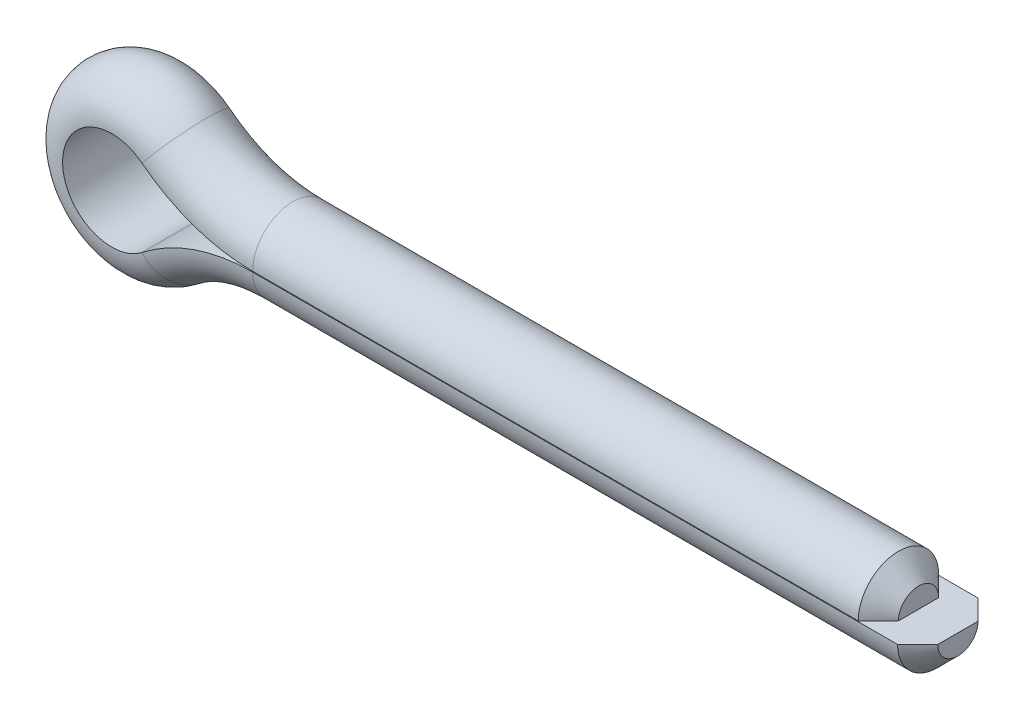
ISO-10303-21;
HEADER;
FILE_DESCRIPTION(('STEP AP214'),'2;1');
FILE_NAME('part.step','',(''),(''),'','','');
FILE_SCHEMA(('AUTOMOTIVE_DESIGN { 1 0 10303 214 1 1 1 1 }'));
ENDSEC;
DATA;
#1=APPLICATION_CONTEXT('core data for automotive mechanical design processes');
#2=APPLICATION_PROTOCOL_DEFINITION('international standard','automotive_design',2000,#1);
#3=PRODUCT_CONTEXT('',#1,'mechanical');
#4=PRODUCT('Part','Part','',(#3));
#5=PRODUCT_RELATED_PRODUCT_CATEGORY('part','',(#4));
#6=PRODUCT_DEFINITION_FORMATION('','',#4);
#7=PRODUCT_DEFINITION_CONTEXT('part definition',#1,'design');
#8=PRODUCT_DEFINITION('design','',#6,#7);
#9=PRODUCT_DEFINITION_SHAPE('','',#8);
#10=(LENGTH_UNIT() NAMED_UNIT(*) SI_UNIT(.MILLI.,.METRE.));
#11=(NAMED_UNIT(*) PLANE_ANGLE_UNIT() SI_UNIT($,.RADIAN.));
#12=(NAMED_UNIT(*) SI_UNIT($,.STERADIAN.) SOLID_ANGLE_UNIT());
#13=UNCERTAINTY_MEASURE_WITH_UNIT(LENGTH_MEASURE(1.E-05),#10,'distance_accuracy_value','');
#14=(GEOMETRIC_REPRESENTATION_CONTEXT(3) GLOBAL_UNCERTAINTY_ASSIGNED_CONTEXT((#13)) GLOBAL_UNIT_ASSIGNED_CONTEXT((#10,
#11,#12)) REPRESENTATION_CONTEXT('',''));
#15=CARTESIAN_POINT('',(0.,0.,0.));
#16=DIRECTION('',(0.,0.,1.));
#17=DIRECTION('',(1.,0.,0.));
#18=AXIS2_PLACEMENT_3D('',#15,#16,#17);
#19=CARTESIAN_POINT('',(-44.4499999999999,-0.0253999999999983,2.8575));
#20=DIRECTION('',(0.,-1.,0.));
#21=DIRECTION('',(1.,0.,0.));
#22=AXIS2_PLACEMENT_3D('',#19,#20,#21);
#23=PLANE('',#22);
#24=DIRECTION('',(1.,0.,0.));
#25=VECTOR('',#24,1.);
#26=CARTESIAN_POINT('',(-44.4499999999999,-0.0253999999999983,2.8575));
#27=LINE('',#26,#25);
#28=CARTESIAN_POINT('',(-44.4499999999999,-0.0253999999999983,2.8575));
#29=VERTEX_POINT('',#28);
#30=CARTESIAN_POINT('',(1.36525000000007,-0.0253999999999983,2.8575));
#31=VERTEX_POINT('',#30);
#32=EDGE_CURVE('E156',#29,#31,#27,.T.);
#33=ORIENTED_EDGE('',*,*,#32,.T.);
#34=DIRECTION('',(-0.707106781186542,0.,0.707106781186553));
#35=VECTOR('',#34,1.);
#36=CARTESIAN_POINT('',(4.22275000000003,-0.0253999999999983,0.));
#37=LINE('',#36,#35);
#38=CARTESIAN_POINT('',(2.79400000000005,-0.0253999999999983,1.42875));
#39=VERTEX_POINT('',#38);
#40=EDGE_CURVE('E167',#31,#39,#37,.F.);
#41=ORIENTED_EDGE('',*,*,#40,.T.);
#42=DIRECTION('',(0.,0.,-1.));
#43=VECTOR('',#42,1.);
#44=CARTESIAN_POINT('',(2.79400000000005,-0.0253999999999983,2.8575));
#45=LINE('',#44,#43);
#46=CARTESIAN_POINT('',(2.79400000000005,-0.0253999999999983,-1.42875));
#47=VERTEX_POINT('',#46);
#48=EDGE_CURVE('E153',#39,#47,#45,.T.);
#49=ORIENTED_EDGE('',*,*,#48,.T.);
#50=DIRECTION('',(0.707106781186542,0.,0.707106781186553));
#51=VECTOR('',#50,1.);
#52=CARTESIAN_POINT('',(4.22275000000003,-0.0253999999999983,0.));
#53=LINE('',#52,#51);
#54=CARTESIAN_POINT('',(1.36525000000007,-0.0253999999999983,-2.8575));
#55=VERTEX_POINT('',#54);
#56=EDGE_CURVE('E165',#47,#55,#53,.F.);
#57=ORIENTED_EDGE('',*,*,#56,.T.);
#58=DIRECTION('',(1.,0.,0.));
#59=VECTOR('',#58,1.);
#60=CARTESIAN_POINT('',(-44.4499999999999,-0.0253999999999983,-2.8575));
#61=LINE('',#60,#59);
#62=CARTESIAN_POINT('',(-44.4499999999999,-0.0253999999999983,-2.8575));
#63=VERTEX_POINT('',#62);
#64=EDGE_CURVE('E159',#63,#55,#61,.T.);
#65=ORIENTED_EDGE('',*,*,#64,.F.);
#66=DIRECTION('',(0.,0.,-1.));
#67=VECTOR('',#66,1.);
#68=CARTESIAN_POINT('',(-44.4499999999999,-0.0253999999999983,2.8575));
#69=LINE('',#68,#67);
#70=EDGE_CURVE('E144',#29,#63,#69,.T.);
#71=ORIENTED_EDGE('',*,*,#70,.F.);
#72=EDGE_LOOP('',(#33,#41,#49,#57,#65,#71));
#73=FACE_BOUND('',#72,.T.);
#74=ADVANCED_FACE('F33',(#73),#23,.F.);
#75=CARTESIAN_POINT('',(-44.4499999999999,-0.0253999999999983,0.));
#76=DIRECTION('',(1.,0.,0.));
#77=DIRECTION('',(0.,1.,0.));
#78=AXIS2_PLACEMENT_3D('',#75,#76,#77);
#79=CYLINDRICAL_SURFACE('',#78,2.8575);
#80=ORIENTED_EDGE('',*,*,#64,.T.);
#81=CARTESIAN_POINT('',(1.36525000000007,-0.0253999999999983,0.));
#82=DIRECTION('',(-1.,0.,0.));
#83=DIRECTION('',(0.,-1.,0.));
#84=AXIS2_PLACEMENT_3D('',#81,#82,#83);
#85=CIRCLE('',#84,2.8575);
#86=EDGE_CURVE('E162',#55,#31,#85,.T.);
#87=ORIENTED_EDGE('',*,*,#86,.T.);
#88=ORIENTED_EDGE('',*,*,#32,.F.);
#89=CARTESIAN_POINT('',(-44.4499999999999,-0.0253999999999983,0.));
#90=DIRECTION('',(-1.,0.,0.));
#91=DIRECTION('',(0.,0.,-1.));
#92=AXIS2_PLACEMENT_3D('',#89,#90,#91);
#93=CIRCLE('',#92,2.8575);
#94=EDGE_CURVE('E141',#63,#29,#93,.T.);
#95=ORIENTED_EDGE('',*,*,#94,.F.);
#96=EDGE_LOOP('',(#80,#87,#88,#95));
#97=FACE_BOUND('',#96,.T.);
#98=ADVANCED_FACE('F187',(#97),#79,.T.);
#99=CARTESIAN_POINT('',(-44.45,-12.7254,0.));
#100=DIRECTION('',(0.,0.,-1.));
#101=DIRECTION('',(-1.,0.,0.));
#102=AXIS2_PLACEMENT_3D('',#99,#100,#101);
#103=CYLINDRICAL_SURFACE('',#102,12.7);
#104=DIRECTION('',(0.,0.,-1.));
#105=VECTOR('',#104,1.);
#106=CARTESIAN_POINT('',(-52.3033757130271,-2.74469411764703,2.8575));
#107=LINE('',#106,#105);
#108=CARTESIAN_POINT('',(-52.3033757130271,-2.74469411764703,2.8575));
#109=VERTEX_POINT('',#108);
#110=CARTESIAN_POINT('',(-52.3033757130271,-2.74469411764703,-2.8575));
#111=VERTEX_POINT('',#110);
#112=EDGE_CURVE('E132',#109,#111,#107,.T.);
#113=ORIENTED_EDGE('',*,*,#112,.F.);
#114=CARTESIAN_POINT('',(-44.45,-12.7254,2.8575));
#115=DIRECTION('',(0.,0.,-1.));
#116=DIRECTION('',(-1.,0.,0.));
#117=AXIS2_PLACEMENT_3D('',#114,#115,#116);
#118=CIRCLE('',#117,12.7);
#119=EDGE_CURVE('E147',#109,#29,#118,.T.);
#120=ORIENTED_EDGE('',*,*,#119,.T.);
#121=ORIENTED_EDGE('',*,*,#70,.T.);
#122=CARTESIAN_POINT('',(-44.45,-12.7254,-2.8575));
#123=DIRECTION('',(0.,0.,-1.));
#124=DIRECTION('',(-1.,0.,0.));
#125=AXIS2_PLACEMENT_3D('',#122,#123,#124);
#126=CIRCLE('',#125,12.7);
#127=EDGE_CURVE('E150',#111,#63,#126,.T.);
#128=ORIENTED_EDGE('',*,*,#127,.F.);
#129=EDGE_LOOP('',(#113,#120,#121,#128));
#130=FACE_BOUND('',#129,.T.);
#131=ADVANCED_FACE('F193',(#130),#103,.T.);
#132=CARTESIAN_POINT('',(-44.45,-12.7254,0.));
#133=DIRECTION('',(0.,0.,-1.));
#134=DIRECTION('',(-1.,0.,0.));
#135=AXIS2_PLACEMENT_3D('',#132,#133,#134);
#136=TOROIDAL_SURFACE('',#135,12.7,2.8575);
#137=CARTESIAN_POINT('',(-52.3033757130271,-2.74469411764703,0.));
#138=DIRECTION('',(-0.785882352941168,-0.618376040395852,0.));
#139=DIRECTION('',(0.,0.,-1.));
#140=AXIS2_PLACEMENT_3D('',#137,#138,#139);
#141=CIRCLE('',#140,2.8575);
#142=EDGE_CURVE('E129',#111,#109,#141,.T.);
#143=ORIENTED_EDGE('',*,*,#142,.F.);
#144=ORIENTED_EDGE('',*,*,#127,.T.);
#145=ORIENTED_EDGE('',*,*,#94,.T.);
#146=ORIENTED_EDGE('',*,*,#119,.F.);
#147=EDGE_LOOP('',(#143,#144,#145,#146));
#148=FACE_BOUND('',#147,.T.);
#149=ADVANCED_FACE('F199',(#148),#136,.T.);
#150=CARTESIAN_POINT('',(-54.4630540341097,0.,0.));
#151=DIRECTION('',(0.,0.,1.));
#152=DIRECTION('',(1.,0.,0.));
#153=AXIS2_PLACEMENT_3D('',#150,#151,#152);
#154=CYLINDRICAL_SURFACE('',#153,3.4925);
#155=DIRECTION('',(0.,0.,-1.));
#156=VECTOR('',#155,1.);
#157=CARTESIAN_POINT('',(-52.3033757130272,2.74469411764706,2.8575));
#158=LINE('',#157,#156);
#159=CARTESIAN_POINT('',(-52.3033757130272,2.74469411764706,2.8575));
#160=VERTEX_POINT('',#159);
#161=CARTESIAN_POINT('',(-52.3033757130272,2.74469411764706,-2.8575));
#162=VERTEX_POINT('',#161);
#163=EDGE_CURVE('E109',#160,#162,#158,.T.);
#164=ORIENTED_EDGE('',*,*,#163,.F.);
#165=CARTESIAN_POINT('',(-54.4630540341097,0.,2.8575));
#166=DIRECTION('',(0.,0.,1.));
#167=DIRECTION('',(1.,0.,0.));
#168=AXIS2_PLACEMENT_3D('',#165,#166,#167);
#169=CIRCLE('',#168,3.4925);
#170=EDGE_CURVE('E135',#160,#109,#169,.T.);
#171=ORIENTED_EDGE('',*,*,#170,.T.);
#172=ORIENTED_EDGE('',*,*,#112,.T.);
#173=CARTESIAN_POINT('',(-54.4630540341097,0.,-2.8575));
#174=DIRECTION('',(0.,0.,1.));
#175=DIRECTION('',(1.,0.,0.));
#176=AXIS2_PLACEMENT_3D('',#173,#174,#175);
#177=CIRCLE('',#176,3.4925);
#178=EDGE_CURVE('E138',#162,#111,#177,.T.);
#179=ORIENTED_EDGE('',*,*,#178,.F.);
#180=EDGE_LOOP('',(#164,#171,#172,#179));
#181=FACE_BOUND('',#180,.T.);
#182=ADVANCED_FACE('F203',(#181),#154,.F.);
#183=CARTESIAN_POINT('',(-54.4630540341097,0.,0.));
#184=DIRECTION('',(0.,0.,1.));
#185=DIRECTION('',(1.,0.,0.));
#186=AXIS2_PLACEMENT_3D('',#183,#184,#185);
#187=TOROIDAL_SURFACE('',#186,3.4925,2.8575);
#188=CARTESIAN_POINT('',(-52.3033757130272,2.74469411764706,0.));
#189=DIRECTION('',(0.785882352941177,-0.618376040395842,0.));
#190=DIRECTION('',(0.,0.,-1.));
#191=AXIS2_PLACEMENT_3D('',#188,#189,#190);
#192=CIRCLE('',#191,2.8575);
#193=EDGE_CURVE('E105',#162,#160,#192,.T.);
#194=ORIENTED_EDGE('',*,*,#193,.F.);
#195=ORIENTED_EDGE('',*,*,#178,.T.);
#196=ORIENTED_EDGE('',*,*,#142,.T.);
#197=ORIENTED_EDGE('',*,*,#170,.F.);
#198=EDGE_LOOP('',(#194,#195,#196,#197));
#199=FACE_BOUND('',#198,.T.);
#200=ADVANCED_FACE('F207',(#199),#187,.T.);
#201=CARTESIAN_POINT('',(-44.45,12.7254,0.));
#202=DIRECTION('',(0.,0.,-1.));
#203=DIRECTION('',(-1.,0.,0.));
#204=AXIS2_PLACEMENT_3D('',#201,#202,#203);
#205=CYLINDRICAL_SURFACE('',#204,12.7);
#206=DIRECTION('',(0.,0.,-1.));
#207=VECTOR('',#206,1.);
#208=CARTESIAN_POINT('',(-44.45,0.0254000000000018,2.8575));
#209=LINE('',#208,#207);
#210=CARTESIAN_POINT('',(-44.45,0.0254000000000018,2.8575));
#211=VERTEX_POINT('',#210);
#212=CARTESIAN_POINT('',(-44.45,0.0254000000000018,-2.8575));
#213=VERTEX_POINT('',#212);
#214=EDGE_CURVE('E112',#211,#213,#209,.T.);
#215=ORIENTED_EDGE('',*,*,#214,.F.);
#216=CARTESIAN_POINT('',(-44.45,12.7254,2.8575));
#217=DIRECTION('',(0.,0.,-1.));
#218=DIRECTION('',(-1.,0.,0.));
#219=AXIS2_PLACEMENT_3D('',#216,#217,#218);
#220=CIRCLE('',#219,12.7);
#221=EDGE_CURVE('E98',#211,#160,#220,.T.);
#222=ORIENTED_EDGE('',*,*,#221,.T.);
#223=ORIENTED_EDGE('',*,*,#163,.T.);
#224=CARTESIAN_POINT('',(-44.45,12.7254,-2.8575));
#225=DIRECTION('',(0.,0.,-1.));
#226=DIRECTION('',(-1.,0.,0.));
#227=AXIS2_PLACEMENT_3D('',#224,#225,#226);
#228=CIRCLE('',#227,12.7);
#229=EDGE_CURVE('E108',#213,#162,#228,.T.);
#230=ORIENTED_EDGE('',*,*,#229,.F.);
#231=EDGE_LOOP('',(#215,#222,#223,#230));
#232=FACE_BOUND('',#231,.T.);
#233=ADVANCED_FACE('F113',(#232),#205,.T.);
#234=CARTESIAN_POINT('',(-44.45,12.7254,0.));
#235=DIRECTION('',(0.,0.,-1.));
#236=DIRECTION('',(-1.,0.,0.));
#237=AXIS2_PLACEMENT_3D('',#234,#235,#236);
#238=TOROIDAL_SURFACE('',#237,12.7,2.8575);
#239=CARTESIAN_POINT('',(-44.45,0.0254000000000018,0.));
#240=DIRECTION('',(1.,0.,0.));
#241=DIRECTION('',(0.,0.,-1.));
#242=AXIS2_PLACEMENT_3D('',#239,#240,#241);
#243=CIRCLE('',#242,2.8575);
#244=EDGE_CURVE('E103',#213,#211,#243,.T.);
#245=ORIENTED_EDGE('',*,*,#244,.F.);
#246=ORIENTED_EDGE('',*,*,#229,.T.);
#247=ORIENTED_EDGE('',*,*,#193,.T.);
#248=ORIENTED_EDGE('',*,*,#221,.F.);
#249=EDGE_LOOP('',(#245,#246,#247,#248));
#250=FACE_BOUND('',#249,.T.);
#251=ADVANCED_FACE('F100',(#250),#238,.T.);
#252=CARTESIAN_POINT('',(-44.45,0.0254000000000018,0.));
#253=DIRECTION('',(1.,0.,0.));
#254=DIRECTION('',(0.,1.,0.));
#255=AXIS2_PLACEMENT_3D('',#252,#253,#254);
#256=CYLINDRICAL_SURFACE('',#255,2.8575);
#257=DIRECTION('',(1.,0.,0.));
#258=VECTOR('',#257,1.);
#259=CARTESIAN_POINT('',(-44.45,0.0254000000000018,2.8575));
#260=LINE('',#259,#258);
#261=CARTESIAN_POINT('',(-1.42875000000001,0.0254000000000001,2.8575));
#262=VERTEX_POINT('',#261);
#263=EDGE_CURVE('E114',#211,#262,#260,.T.);
#264=ORIENTED_EDGE('',*,*,#263,.T.);
#265=CARTESIAN_POINT('',(-1.42875000000001,0.0254000000000001,0.));
#266=DIRECTION('',(1.,0.,0.));
#267=DIRECTION('',(0.,1.,0.));
#268=AXIS2_PLACEMENT_3D('',#265,#266,#267);
#269=CIRCLE('',#268,2.8575);
#270=CARTESIAN_POINT('',(-1.42875000000001,0.0254000000000001,-2.8575));
#271=VERTEX_POINT('',#270);
#272=EDGE_CURVE('E11',#262,#271,#269,.F.);
#273=ORIENTED_EDGE('',*,*,#272,.T.);
#274=DIRECTION('',(1.,0.,0.));
#275=VECTOR('',#274,1.);
#276=CARTESIAN_POINT('',(-44.45,0.0254000000000018,-2.8575));
#277=LINE('',#276,#275);
#278=EDGE_CURVE('E117',#213,#271,#277,.T.);
#279=ORIENTED_EDGE('',*,*,#278,.F.);
#280=ORIENTED_EDGE('',*,*,#244,.T.);
#281=EDGE_LOOP('',(#264,#273,#279,#280));
#282=FACE_BOUND('',#281,.T.);
#283=ADVANCED_FACE('F119',(#282),#256,.T.);
#284=CARTESIAN_POINT('',(-44.45,0.0254000000000018,2.8575));
#285=DIRECTION('',(0.,-1.,0.));
#286=DIRECTION('',(1.,0.,0.));
#287=AXIS2_PLACEMENT_3D('',#284,#285,#286);
#288=PLANE('',#287);
#289=DIRECTION('',(0.,0.,-1.));
#290=VECTOR('',#289,1.);
#291=CARTESIAN_POINT('',(0.,0.0254,2.8575));
#292=LINE('',#291,#290);
#293=CARTESIAN_POINT('',(0.,0.0254,1.42874999999999));
#294=VERTEX_POINT('',#293);
#295=CARTESIAN_POINT('',(0.,0.0254,-1.42874999999999));
#296=VERTEX_POINT('',#295);
#297=EDGE_CURVE('E120',#294,#296,#292,.T.);
#298=ORIENTED_EDGE('',*,*,#297,.F.);
#299=DIRECTION('',(-0.707106781186547,0.,0.707106781186548));
#300=VECTOR('',#299,1.);
#301=CARTESIAN_POINT('',(1.42874999999999,0.0253999999999999,0.));
#302=LINE('',#301,#300);
#303=EDGE_CURVE('E41',#294,#262,#302,.T.);
#304=ORIENTED_EDGE('',*,*,#303,.T.);
#305=ORIENTED_EDGE('',*,*,#263,.F.);
#306=ORIENTED_EDGE('',*,*,#214,.T.);
#307=ORIENTED_EDGE('',*,*,#278,.T.);
#308=DIRECTION('',(0.707106781186547,0.,0.707106781186548));
#309=VECTOR('',#308,1.);
#310=CARTESIAN_POINT('',(1.42874999999999,0.0253999999999999,0.));
#311=LINE('',#310,#309);
#312=EDGE_CURVE('E174',#271,#296,#311,.T.);
#313=ORIENTED_EDGE('',*,*,#312,.T.);
#314=EDGE_LOOP('',(#298,#304,#305,#306,#307,#313));
#315=FACE_BOUND('',#314,.T.);
#316=ADVANCED_FACE('F116',(#315),#288,.T.);
#317=CARTESIAN_POINT('',(2.79400000000005,-0.0253999999999983,0.));
#318=DIRECTION('',(-1.,0.,0.));
#319=DIRECTION('',(0.,0.,-1.));
#320=AXIS2_PLACEMENT_3D('',#317,#318,#319);
#321=PLANE('',#320);
#322=ORIENTED_EDGE('',*,*,#48,.F.);
#323=CARTESIAN_POINT('',(2.79400000000005,-0.0253999999999983,0.));
#324=DIRECTION('',(-1.,0.,0.));
#325=DIRECTION('',(0.,-1.,0.));
#326=AXIS2_PLACEMENT_3D('',#323,#324,#325);
#327=CIRCLE('',#326,1.42875);
#328=EDGE_CURVE('E169',#39,#47,#327,.F.);
#329=ORIENTED_EDGE('',*,*,#328,.T.);
#330=EDGE_LOOP('',(#322,#329));
#331=FACE_BOUND('',#330,.T.);
#332=ADVANCED_FACE('F220',(#331),#321,.F.);
#333=CARTESIAN_POINT('',(0.,0.0254,0.));
#334=DIRECTION('',(1.,0.,0.));
#335=DIRECTION('',(0.,0.,-1.));
#336=AXIS2_PLACEMENT_3D('',#333,#334,#335);
#337=PLANE('',#336);
#338=ORIENTED_EDGE('',*,*,#297,.T.);
#339=CARTESIAN_POINT('',(0.,0.0254,0.));
#340=DIRECTION('',(1.,0.,0.));
#341=DIRECTION('',(0.,0.,-1.));
#342=AXIS2_PLACEMENT_3D('',#339,#340,#341);
#343=CIRCLE('',#342,1.42874999999999);
#344=EDGE_CURVE('E171',#296,#294,#343,.T.);
#345=ORIENTED_EDGE('',*,*,#344,.T.);
#346=EDGE_LOOP('',(#338,#345));
#347=FACE_BOUND('',#346,.T.);
#348=ADVANCED_FACE('F179',(#347),#337,.T.);
#349=CARTESIAN_POINT('',(1.36525000000007,-0.0253999999999983,0.));
#350=DIRECTION('',(-1.,0.,0.));
#351=DIRECTION('',(0.,-1.,0.));
#352=AXIS2_PLACEMENT_3D('',#349,#350,#351);
#353=CONICAL_SURFACE('',#352,2.8575,0.785398163397456);
#354=ORIENTED_EDGE('',*,*,#56,.F.);
#355=ORIENTED_EDGE('',*,*,#328,.F.);
#356=ORIENTED_EDGE('',*,*,#40,.F.);
#357=ORIENTED_EDGE('',*,*,#86,.F.);
#358=EDGE_LOOP('',(#354,#355,#356,#357));
#359=FACE_BOUND('',#358,.T.);
#360=ADVANCED_FACE('F181',(#359),#353,.T.);
#361=CARTESIAN_POINT('',(0.,0.0254,0.));
#362=DIRECTION('',(-1.,0.,0.));
#363=DIRECTION('',(0.,-1.,0.));
#364=AXIS2_PLACEMENT_3D('',#361,#362,#363);
#365=CONICAL_SURFACE('',#364,1.42874999999999,0.785398163397449);
#366=ORIENTED_EDGE('',*,*,#312,.F.);
#367=ORIENTED_EDGE('',*,*,#272,.F.);
#368=ORIENTED_EDGE('',*,*,#303,.F.);
#369=ORIENTED_EDGE('',*,*,#344,.F.);
#370=EDGE_LOOP('',(#366,#367,#368,#369));
#371=FACE_BOUND('',#370,.T.);
#372=ADVANCED_FACE('F35',(#371),#365,.T.);
#373=CLOSED_SHELL('',(#74,#98,#131,#149,#182,#200,#233,#251,#283,#316,#332,#348,#360,#372));
#374=MANIFOLD_SOLID_BREP('B2',#373);
#375=ADVANCED_BREP_SHAPE_REPRESENTATION('',(#18,#374),#14);
#376=SHAPE_DEFINITION_REPRESENTATION(#9,#375);
ENDSEC;
END-ISO-10303-21;
